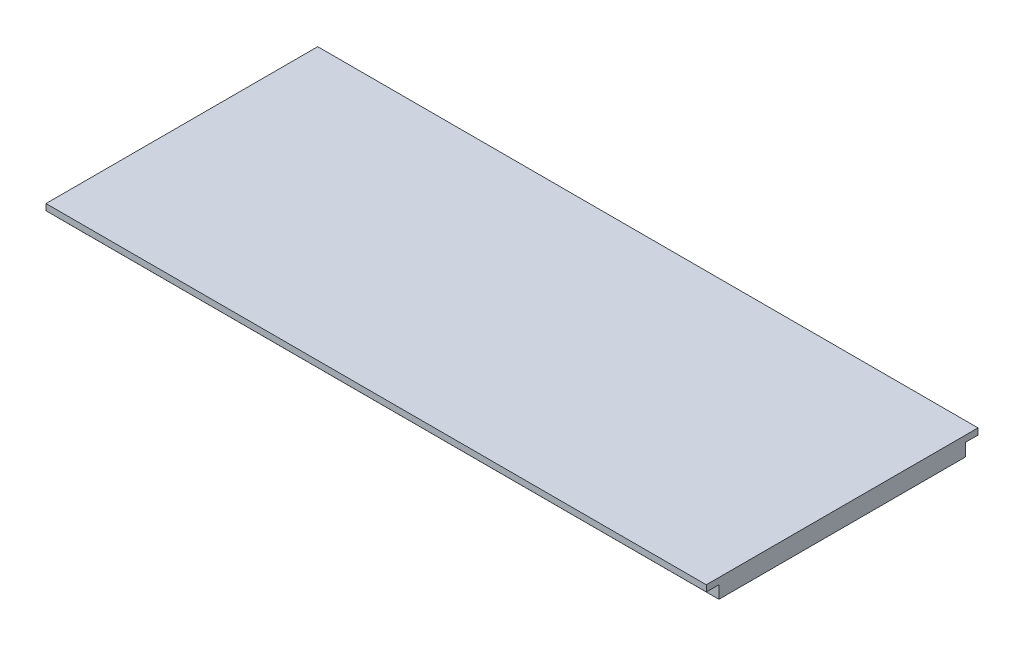
ISO-10303-21;
HEADER;
FILE_DESCRIPTION(('STEP AP214'),'2;1');
FILE_NAME('part.step','',(''),(''),'','','');
FILE_SCHEMA(('AUTOMOTIVE_DESIGN { 1 0 10303 214 1 1 1 1 }'));
ENDSEC;
DATA;
#1=APPLICATION_CONTEXT('core data for automotive mechanical design processes');
#2=APPLICATION_PROTOCOL_DEFINITION('international standard','automotive_design',2000,#1);
#3=PRODUCT_CONTEXT('',#1,'mechanical');
#4=PRODUCT('Part','Part','',(#3));
#5=PRODUCT_RELATED_PRODUCT_CATEGORY('part','',(#4));
#6=PRODUCT_DEFINITION_FORMATION('','',#4);
#7=PRODUCT_DEFINITION_CONTEXT('part definition',#1,'design');
#8=PRODUCT_DEFINITION('design','',#6,#7);
#9=PRODUCT_DEFINITION_SHAPE('','',#8);
#10=(LENGTH_UNIT() NAMED_UNIT(*) SI_UNIT(.MILLI.,.METRE.));
#11=(NAMED_UNIT(*) PLANE_ANGLE_UNIT() SI_UNIT($,.RADIAN.));
#12=(NAMED_UNIT(*) SI_UNIT($,.STERADIAN.) SOLID_ANGLE_UNIT());
#13=UNCERTAINTY_MEASURE_WITH_UNIT(LENGTH_MEASURE(1.E-05),#10,'distance_accuracy_value','');
#14=(GEOMETRIC_REPRESENTATION_CONTEXT(3) GLOBAL_UNCERTAINTY_ASSIGNED_CONTEXT((#13)) GLOBAL_UNIT_ASSIGNED_CONTEXT((#10,
#11,#12)) REPRESENTATION_CONTEXT('',''));
#15=CARTESIAN_POINT('',(0.,0.,0.));
#16=DIRECTION('',(0.,0.,1.));
#17=DIRECTION('',(1.,0.,0.));
#18=AXIS2_PLACEMENT_3D('',#15,#16,#17);
#19=CARTESIAN_POINT('',(-126.158859736553,-1.39491616665509,59.5667975060498));
#20=CARTESIAN_POINT('',(-126.158859736553,-1.48029661431821,61.5160693440243));
#21=CARTESIAN_POINT('',(-126.158859736553,-4.04894196367185,64.6148790021447));
#22=CARTESIAN_POINT('',(-126.158859736553,-9.90751310898822,61.8880120971785));
#23=CARTESIAN_POINT('',(-126.158859736553,-7.09308720635287,51.2562433251617));
#24=CARTESIAN_POINT('',(-126.158859736553,-1.70242173135367,44.0648360638056));
#25=CARTESIAN_POINT('',(-126.158859736553,-4.54860947372664,37.3845601025686));
#26=B_SPLINE_CURVE_WITH_KNOTS('',3,(#19,#20,#21,#22,#23,#24,#25),.UNSPECIFIED.,.F.,.F.,(4,1,1,1,
4),(0.,0.14225520680941,0.248971973828275,0.491101119975842,1.),.UNSPECIFIED.);
#27=DIRECTION('',(1.,0.,0.));
#28=VECTOR('',#27,1.);
#29=SURFACE_OF_LINEAR_EXTRUSION('',#26,#28);
#30=CARTESIAN_POINT('',(-88.0588597365526,-1.39491616665509,59.5667975060498));
#31=CARTESIAN_POINT('',(-88.0588597365526,-1.48029661431821,61.5160693440243));
#32=CARTESIAN_POINT('',(-88.0588597365526,-4.04894196367185,64.6148790021447));
#33=CARTESIAN_POINT('',(-88.0588597365526,-9.90751310898822,61.8880120971785));
#34=CARTESIAN_POINT('',(-88.0588597365526,-7.09308720635287,51.2562433251616));
#35=CARTESIAN_POINT('',(-88.0588597365526,-1.70242173135367,44.0648360638056));
#36=CARTESIAN_POINT('',(-88.0588597365526,-4.54860947372664,37.3845601025686));
#37=B_SPLINE_CURVE_WITH_KNOTS('',3,(#30,#31,#32,#33,#34,#35,#36),.UNSPECIFIED.,.F.,.F.,(4,1,1,1,
4),(0.,0.14225520680941,0.248971973828275,0.491101119975842,1.),.UNSPECIFIED.);
#38=CARTESIAN_POINT('',(-88.0588597365526,-1.39491616665509,59.5667975060498));
#39=VERTEX_POINT('',#38);
#40=CARTESIAN_POINT('',(-88.0588597365526,-4.54860947372663,37.3845601025686));
#41=VERTEX_POINT('',#40);
#42=EDGE_CURVE('E200',#39,#41,#37,.T.);
#43=ORIENTED_EDGE('',*,*,#42,.T.);
#44=DIRECTION('',(1.,0.,0.));
#45=VECTOR('',#44,1.);
#46=CARTESIAN_POINT('',(-126.158859736553,-4.54860947372663,37.3845601025686));
#47=LINE('',#46,#45);
#48=CARTESIAN_POINT('',(-126.158859736553,-4.54860947372663,37.3845601025686));
#49=VERTEX_POINT('',#48);
#50=EDGE_CURVE('E285',#49,#41,#47,.T.);
#51=ORIENTED_EDGE('',*,*,#50,.F.);
#52=CARTESIAN_POINT('',(-126.158859736553,-1.3949161666551,59.5667975060498));
#53=VERTEX_POINT('',#52);
#54=EDGE_CURVE('E201',#53,#49,#26,.T.);
#55=ORIENTED_EDGE('',*,*,#54,.F.);
#56=DIRECTION('',(1.,0.,0.));
#57=VECTOR('',#56,1.);
#58=CARTESIAN_POINT('',(-126.158859736553,-1.3949161666551,59.5667975060498));
#59=LINE('',#58,#57);
#60=EDGE_CURVE('E346',#53,#39,#59,.T.);
#61=ORIENTED_EDGE('',*,*,#60,.T.);
#62=EDGE_LOOP('',(#43,#51,#55,#61));
#63=FACE_BOUND('',#62,.T.);
#64=CARTESIAN_POINT('',(-95.6788597365526,-1.39491616665509,59.5667975060498));
#65=CARTESIAN_POINT('',(-95.6788597365526,-1.48029661431821,61.5160693440243));
#66=CARTESIAN_POINT('',(-95.6788597365526,-4.04894196367185,64.6148790021447));
#67=CARTESIAN_POINT('',(-95.6788597365526,-9.90751310898822,61.8880120971785));
#68=CARTESIAN_POINT('',(-95.6788597365526,-7.09308720635287,51.2562433251616));
#69=CARTESIAN_POINT('',(-95.6788597365526,-1.70242173135367,44.0648360638056));
#70=CARTESIAN_POINT('',(-95.6788597365526,-4.54860947372664,37.3845601025686));
#71=B_SPLINE_CURVE_WITH_KNOTS('',3,(#64,#65,#66,#67,#68,#69,#70),.UNSPECIFIED.,.F.,.F.,(4,1,1,1,
4),(0.,0.14225520680941,0.248971973828275,0.491101119975842,1.),.UNSPECIFIED.);
#72=CARTESIAN_POINT('',(-95.6788597365526,-8.50681272936786,57.2956126286987));
#73=VERTEX_POINT('',#72);
#74=CARTESIAN_POINT('',(-95.6788597365526,-3.92571770064945,45.502355942327));
#75=VERTEX_POINT('',#74);
#76=EDGE_CURVE('E164',#73,#75,#71,.T.);
#77=ORIENTED_EDGE('',*,*,#76,.F.);
#78=DIRECTION('',(1.,0.,0.));
#79=VECTOR('',#78,1.);
#80=CARTESIAN_POINT('',(-126.158859736553,-8.50681272936786,57.2956126286987));
#81=LINE('',#80,#79);
#82=CARTESIAN_POINT('',(-118.538859736553,-8.50681272936786,57.2956126286987));
#83=VERTEX_POINT('',#82);
#84=EDGE_CURVE('E186',#83,#73,#81,.T.);
#85=ORIENTED_EDGE('',*,*,#84,.F.);
#86=CARTESIAN_POINT('',(-118.538859736553,-1.39491616665509,59.5667975060498));
#87=CARTESIAN_POINT('',(-118.538859736553,-1.48029661431821,61.5160693440243));
#88=CARTESIAN_POINT('',(-118.538859736553,-4.04894196367185,64.6148790021447));
#89=CARTESIAN_POINT('',(-118.538859736553,-9.90751310898822,61.8880120971785));
#90=CARTESIAN_POINT('',(-118.538859736553,-7.09308720635287,51.2562433251617));
#91=CARTESIAN_POINT('',(-118.538859736553,-1.70242173135367,44.0648360638056));
#92=CARTESIAN_POINT('',(-118.538859736553,-4.54860947372664,37.3845601025686));
#93=B_SPLINE_CURVE_WITH_KNOTS('',3,(#86,#87,#88,#89,#90,#91,#92),.UNSPECIFIED.,.F.,.F.,(4,1,1,1,
4),(0.,0.14225520680941,0.248971973828275,0.491101119975842,1.),.UNSPECIFIED.);
#94=CARTESIAN_POINT('',(-118.538859736553,-3.92571770118928,45.502355942327));
#95=VERTEX_POINT('',#94);
#96=EDGE_CURVE('E188',#95,#83,#93,.F.);
#97=ORIENTED_EDGE('',*,*,#96,.F.);
#98=DIRECTION('',(1.,0.,0.));
#99=VECTOR('',#98,1.);
#100=CARTESIAN_POINT('',(-126.158859736553,-3.92571770064945,45.502355942327));
#101=LINE('',#100,#99);
#102=EDGE_CURVE('E192',#75,#95,#101,.F.);
#103=ORIENTED_EDGE('',*,*,#102,.F.);
#104=EDGE_LOOP('',(#77,#85,#97,#103));
#105=FACE_BOUND('',#104,.T.);
#106=ADVANCED_FACE('F36',(#63,#105),#29,.F.);
#107=CARTESIAN_POINT('',(-126.158859736553,-5.71698411480681,37.882355942327));
#108=CARTESIAN_POINT('',(-126.158859736553,-5.56334220902802,38.2429548334276));
#109=CARTESIAN_POINT('',(-126.158859736553,-5.28108494498123,38.9981374318016));
#110=CARTESIAN_POINT('',(-126.158859736553,-4.90892600324813,40.393560708878));
#111=CARTESIAN_POINT('',(-126.158859736553,-4.71932610533275,42.062160420203));
#112=CARTESIAN_POINT('',(-126.158859736553,-4.86196655765765,43.9810949091955));
#113=CARTESIAN_POINT('',(-126.158859736553,-5.45479976802843,46.5228523588809));
#114=CARTESIAN_POINT('',(-126.158859736553,-6.80646332334239,49.7569525071542));
#115=CARTESIAN_POINT('',(-126.158859736553,-8.4479282894016,53.2151114838994));
#116=CARTESIAN_POINT('',(-126.158859736553,-9.58908910753317,56.2637640118195));
#117=CARTESIAN_POINT('',(-126.158859736553,-10.1489465903297,58.6405053384097));
#118=CARTESIAN_POINT('',(-126.158859736553,-10.1157085610259,60.6603570457638));
#119=CARTESIAN_POINT('',(-126.158859736553,-9.54794373951042,62.2267501871865));
#120=CARTESIAN_POINT('',(-126.158859736553,-8.79448229134296,63.2945408435051));
#121=CARTESIAN_POINT('',(-126.158859736553,-7.74531410843987,64.1592455880178));
#122=CARTESIAN_POINT('',(-126.158859736553,-6.47688200560097,64.7616399765848));
#123=CARTESIAN_POINT('',(-126.158859736553,-5.01238982416159,65.0116930969087));
#124=CARTESIAN_POINT('',(-126.158859736553,-3.43892818214929,64.6757218015532));
#125=CARTESIAN_POINT('',(-126.158859736553,-2.14242727495017,63.8441999613932));
#126=CARTESIAN_POINT('',(-126.158859736553,-1.1018182514522,62.6838984715983));
#127=CARTESIAN_POINT('',(-126.158859736553,-0.373254595908957,61.2718107426635));
#128=CARTESIAN_POINT('',(-126.158859736553,-0.149654943870442,60.1683831356787));
#129=CARTESIAN_POINT('',(-126.158859736553,-0.125757298236289,59.6226222586608));
#130=B_SPLINE_CURVE_WITH_KNOTS('',3,(#107,#108,#109,#110,#111,#112,#113,#114,#115,#116,#117,
#118,#119,#120,#121,#122,#123,#124,#125,#126,#127,#128,#129),.UNSPECIFIED.,.F.,.F.,(4,1,1,1,1,1,
1,1,1,1,1,1,1,1,1,1,1,1,1,1,4),(0.,0.03125,0.0625,0.125,0.1875,0.25,0.375,0.5,0.5625,0.625,
0.6875,0.71875,0.75,0.78125,0.8125,0.84375,0.875,0.90625,0.9375,0.96875,1.),.UNSPECIFIED.);
#131=DIRECTION('',(1.,0.,0.));
#132=VECTOR('',#131,1.);
#133=SURFACE_OF_LINEAR_EXTRUSION('',#130,#132);
#134=CARTESIAN_POINT('',(-88.0588597365526,-5.71698411480681,37.882355942327));
#135=CARTESIAN_POINT('',(-88.0588597365526,-5.56334220902802,38.2429548334276));
#136=CARTESIAN_POINT('',(-88.0588597365526,-5.28108494498123,38.9981374318016));
#137=CARTESIAN_POINT('',(-88.0588597365526,-4.90892600324813,40.3935607088779));
#138=CARTESIAN_POINT('',(-88.0588597365526,-4.71932610533275,42.062160420203));
#139=CARTESIAN_POINT('',(-88.0588597365526,-4.86196655765765,43.9810949091954));
#140=CARTESIAN_POINT('',(-88.0588597365526,-5.45479976802843,46.5228523588809));
#141=CARTESIAN_POINT('',(-88.0588597365526,-6.80646332334239,49.7569525071542));
#142=CARTESIAN_POINT('',(-88.0588597365526,-8.4479282894016,53.2151114838993));
#143=CARTESIAN_POINT('',(-88.0588597365526,-9.58908910753317,56.2637640118195));
#144=CARTESIAN_POINT('',(-88.0588597365526,-10.1489465903297,58.6405053384097));
#145=CARTESIAN_POINT('',(-88.0588597365526,-10.1157085610259,60.6603570457638));
#146=CARTESIAN_POINT('',(-88.0588597365526,-9.54794373951042,62.2267501871865));
#147=CARTESIAN_POINT('',(-88.0588597365526,-8.79448229134296,63.2945408435051));
#148=CARTESIAN_POINT('',(-88.0588597365526,-7.74531410843987,64.1592455880178));
#149=CARTESIAN_POINT('',(-88.0588597365526,-6.47688200560097,64.7616399765848));
#150=CARTESIAN_POINT('',(-88.0588597365526,-5.01238982416159,65.0116930969086));
#151=CARTESIAN_POINT('',(-88.0588597365526,-3.43892818214929,64.6757218015532));
#152=CARTESIAN_POINT('',(-88.0588597365526,-2.14242727495017,63.8441999613931));
#153=CARTESIAN_POINT('',(-88.0588597365526,-1.1018182514522,62.6838984715983));
#154=CARTESIAN_POINT('',(-88.0588597365526,-0.373254595908957,61.2718107426635));
#155=CARTESIAN_POINT('',(-88.0588597365526,-0.149654943870442,60.1683831356787));
#156=CARTESIAN_POINT('',(-88.0588597365526,-0.125757298236289,59.6226222586608));
#157=B_SPLINE_CURVE_WITH_KNOTS('',3,(#134,#135,#136,#137,#138,#139,#140,#141,#142,#143,#144,
#145,#146,#147,#148,#149,#150,#151,#152,#153,#154,#155,#156),.UNSPECIFIED.,.F.,.F.,(4,1,1,1,1,1,
1,1,1,1,1,1,1,1,1,1,1,1,1,1,4),(0.,0.03125,0.0625,0.125,0.1875,0.25,0.375,0.5,0.5625,0.625,
0.6875,0.71875,0.75,0.78125,0.8125,0.84375,0.875,0.90625,0.9375,0.96875,1.),.UNSPECIFIED.);
#158=CARTESIAN_POINT('',(-88.0588597365526,-5.71698411480681,37.882355942327));
#159=VERTEX_POINT('',#158);
#160=CARTESIAN_POINT('',(-88.0588597365526,-1.39491616665514,62.9685125939913));
#161=VERTEX_POINT('',#160);
#162=EDGE_CURVE('E352',#159,#161,#157,.T.);
#163=ORIENTED_EDGE('',*,*,#162,.T.);
#164=DIRECTION('',(1.,0.,0.));
#165=VECTOR('',#164,1.);
#166=CARTESIAN_POINT('',(-126.158859736553,-1.39491616665514,62.9685125939913));
#167=LINE('',#166,#165);
#168=CARTESIAN_POINT('',(-126.158859736553,-1.39491616665514,62.9685125939913));
#169=VERTEX_POINT('',#168);
#170=EDGE_CURVE('E343',#169,#161,#167,.T.);
#171=ORIENTED_EDGE('',*,*,#170,.F.);
#172=CARTESIAN_POINT('',(-126.158859736553,-5.71698411480681,37.882355942327));
#173=VERTEX_POINT('',#172);
#174=EDGE_CURVE('E368',#173,#169,#130,.T.);
#175=ORIENTED_EDGE('',*,*,#174,.F.);
#176=DIRECTION('',(1.,0.,0.));
#177=VECTOR('',#176,1.);
#178=CARTESIAN_POINT('',(-126.158859736553,-5.71698411480681,37.882355942327));
#179=LINE('',#178,#177);
#180=EDGE_CURVE('E340',#173,#159,#179,.T.);
#181=ORIENTED_EDGE('',*,*,#180,.T.);
#182=EDGE_LOOP('',(#163,#171,#175,#181));
#183=FACE_BOUND('',#182,.T.);
#184=CARTESIAN_POINT('',(-95.6788597365526,-5.71698411480681,37.882355942327));
#185=CARTESIAN_POINT('',(-95.6788597365526,-5.56334220902802,38.2429548334276));
#186=CARTESIAN_POINT('',(-95.6788597365526,-5.28108494498123,38.9981374318016));
#187=CARTESIAN_POINT('',(-95.6788597365526,-4.90892600324813,40.3935607088779));
#188=CARTESIAN_POINT('',(-95.6788597365526,-4.71932610533275,42.062160420203));
#189=CARTESIAN_POINT('',(-95.6788597365526,-4.86196655765765,43.9810949091954));
#190=CARTESIAN_POINT('',(-95.6788597365526,-5.45479976802843,46.5228523588809));
#191=CARTESIAN_POINT('',(-95.6788597365526,-6.80646332334239,49.7569525071542));
#192=CARTESIAN_POINT('',(-95.6788597365526,-8.4479282894016,53.2151114838993));
#193=CARTESIAN_POINT('',(-95.6788597365526,-9.58908910753317,56.2637640118195));
#194=CARTESIAN_POINT('',(-95.6788597365526,-10.1489465903297,58.6405053384097));
#195=CARTESIAN_POINT('',(-95.6788597365526,-10.1157085610259,60.6603570457638));
#196=CARTESIAN_POINT('',(-95.6788597365526,-9.54794373951042,62.2267501871865));
#197=CARTESIAN_POINT('',(-95.6788597365526,-8.79448229134296,63.2945408435051));
#198=CARTESIAN_POINT('',(-95.6788597365526,-7.74531410843987,64.1592455880178));
#199=CARTESIAN_POINT('',(-95.6788597365526,-6.47688200560097,64.7616399765848));
#200=CARTESIAN_POINT('',(-95.6788597365526,-5.01238982416159,65.0116930969086));
#201=CARTESIAN_POINT('',(-95.6788597365526,-3.43892818214929,64.6757218015532));
#202=CARTESIAN_POINT('',(-95.6788597365526,-2.14242727495017,63.8441999613931));
#203=CARTESIAN_POINT('',(-95.6788597365526,-1.1018182514522,62.6838984715983));
#204=CARTESIAN_POINT('',(-95.6788597365526,-0.373254595908957,61.2718107426635));
#205=CARTESIAN_POINT('',(-95.6788597365526,-0.149654943870442,60.1683831356787));
#206=CARTESIAN_POINT('',(-95.6788597365526,-0.125757298236289,59.6226222586608));
#207=B_SPLINE_CURVE_WITH_KNOTS('',3,(#184,#185,#186,#187,#188,#189,#190,#191,#192,#193,#194,
#195,#196,#197,#198,#199,#200,#201,#202,#203,#204,#205,#206),.UNSPECIFIED.,.F.,.F.,(4,1,1,1,1,1,
1,1,1,1,1,1,1,1,1,1,1,1,1,1,4),(0.,0.03125,0.0625,0.125,0.1875,0.25,0.375,0.5,0.5625,0.625,
0.6875,0.71875,0.75,0.78125,0.8125,0.84375,0.875,0.90625,0.9375,0.96875,1.),.UNSPECIFIED.);
#208=CARTESIAN_POINT('',(-95.6788597365527,-9.8142459307497,57.2956126286987));
#209=VERTEX_POINT('',#208);
#210=CARTESIAN_POINT('',(-95.6788597365526,-5.23736869912946,45.502355942327));
#211=VERTEX_POINT('',#210);
#212=EDGE_CURVE('E161',#209,#211,#207,.F.);
#213=ORIENTED_EDGE('',*,*,#212,.T.);
#214=DIRECTION('',(1.,0.,0.));
#215=VECTOR('',#214,1.);
#216=CARTESIAN_POINT('',(-126.158859736553,-5.23736869912969,45.5023559423271));
#217=LINE('',#216,#215);
#218=CARTESIAN_POINT('',(-118.538859736553,-5.23736869912969,45.5023559423271));
#219=VERTEX_POINT('',#218);
#220=EDGE_CURVE('E148',#211,#219,#217,.F.);
#221=ORIENTED_EDGE('',*,*,#220,.T.);
#222=CARTESIAN_POINT('',(-118.538859736553,-5.71698411480681,37.882355942327));
#223=CARTESIAN_POINT('',(-118.538859736553,-5.56334220902802,38.2429548334276));
#224=CARTESIAN_POINT('',(-118.538859736553,-5.28108494498123,38.9981374318016));
#225=CARTESIAN_POINT('',(-118.538859736553,-4.90892600324813,40.393560708878));
#226=CARTESIAN_POINT('',(-118.538859736553,-4.71932610533275,42.062160420203));
#227=CARTESIAN_POINT('',(-118.538859736553,-4.86196655765765,43.9810949091955));
#228=CARTESIAN_POINT('',(-118.538859736553,-5.45479976802843,46.5228523588809));
#229=CARTESIAN_POINT('',(-118.538859736553,-6.80646332334239,49.7569525071542));
#230=CARTESIAN_POINT('',(-118.538859736553,-8.4479282894016,53.2151114838994));
#231=CARTESIAN_POINT('',(-118.538859736553,-9.58908910753317,56.2637640118195));
#232=CARTESIAN_POINT('',(-118.538859736553,-10.1489465903297,58.6405053384097));
#233=CARTESIAN_POINT('',(-118.538859736553,-10.1157085610259,60.6603570457638));
#234=CARTESIAN_POINT('',(-118.538859736553,-9.54794373951042,62.2267501871865));
#235=CARTESIAN_POINT('',(-118.538859736553,-8.79448229134296,63.2945408435051));
#236=CARTESIAN_POINT('',(-118.538859736553,-7.74531410843987,64.1592455880178));
#237=CARTESIAN_POINT('',(-118.538859736553,-6.47688200560097,64.7616399765848));
#238=CARTESIAN_POINT('',(-118.538859736553,-5.01238982416159,65.0116930969087));
#239=CARTESIAN_POINT('',(-118.538859736553,-3.43892818214929,64.6757218015532));
#240=CARTESIAN_POINT('',(-118.538859736553,-2.14242727495017,63.8441999613932));
#241=CARTESIAN_POINT('',(-118.538859736553,-1.1018182514522,62.6838984715983));
#242=CARTESIAN_POINT('',(-118.538859736553,-0.373254595908957,61.2718107426635));
#243=CARTESIAN_POINT('',(-118.538859736553,-0.149654943870442,60.1683831356787));
#244=CARTESIAN_POINT('',(-118.538859736553,-0.125757298236289,59.6226222586608));
#245=B_SPLINE_CURVE_WITH_KNOTS('',3,(#222,#223,#224,#225,#226,#227,#228,#229,#230,#231,#232,
#233,#234,#235,#236,#237,#238,#239,#240,#241,#242,#243,#244),.UNSPECIFIED.,.F.,.F.,(4,1,1,1,1,1,
1,1,1,1,1,1,1,1,1,1,1,1,1,1,4),(0.,0.03125,0.0625,0.125,0.1875,0.25,0.375,0.5,0.5625,0.625,
0.6875,0.71875,0.75,0.78125,0.8125,0.84375,0.875,0.90625,0.9375,0.96875,1.),.UNSPECIFIED.);
#246=CARTESIAN_POINT('',(-118.538859736553,-9.81424593075065,57.2956126287028));
#247=VERTEX_POINT('',#246);
#248=EDGE_CURVE('E176',#219,#247,#245,.T.);
#249=ORIENTED_EDGE('',*,*,#248,.T.);
#250=DIRECTION('',(1.,0.,0.));
#251=VECTOR('',#250,1.);
#252=CARTESIAN_POINT('',(-126.158859736553,-9.8142459307497,57.2956126286987));
#253=LINE('',#252,#251);
#254=EDGE_CURVE('E167',#247,#209,#253,.T.);
#255=ORIENTED_EDGE('',*,*,#254,.T.);
#256=EDGE_LOOP('',(#213,#221,#249,#255));
#257=FACE_BOUND('',#256,.T.);
#258=ADVANCED_FACE('F166',(#183,#257),#133,.F.);
#259=CARTESIAN_POINT('',(-3.454335612048,-1.39491616665509,0.));
#260=DIRECTION('',(0.,-1.,0.));
#261=DIRECTION('',(0.,0.,-1.));
#262=AXIS2_PLACEMENT_3D('',#259,#260,#261);
#263=PLANE('',#262);
#264=DIRECTION('',(0.,0.,-1.));
#265=VECTOR('',#264,1.);
#266=CARTESIAN_POINT('',(-47.0668597365527,-1.39491616665509,0.));
#267=LINE('',#266,#265);
#268=CARTESIAN_POINT('',(-47.0668597365526,-1.39491616665509,78.5853825453996));
#269=VERTEX_POINT('',#268);
#270=CARTESIAN_POINT('',(-47.0668597365527,-1.39491616665509,39.5853825453996));
#271=VERTEX_POINT('',#270);
#272=EDGE_CURVE('E44',#269,#271,#267,.T.);
#273=ORIENTED_EDGE('',*,*,#272,.F.);
#274=DIRECTION('',(-1.,0.,0.));
#275=VECTOR('',#274,1.);
#276=CARTESIAN_POINT('',(-3.454335612048,-1.39491616665509,78.5853825453996));
#277=LINE('',#276,#275);
#278=CARTESIAN_POINT('',(-151.558859736553,-1.39491616665509,78.5853825453997));
#279=VERTEX_POINT('',#278);
#280=EDGE_CURVE('E265',#269,#279,#277,.T.);
#281=ORIENTED_EDGE('',*,*,#280,.T.);
#282=DIRECTION('',(0.,0.,1.));
#283=VECTOR('',#282,1.);
#284=CARTESIAN_POINT('',(-151.558859736553,-1.39491616665509,0.));
#285=LINE('',#284,#283);
#286=CARTESIAN_POINT('',(-151.558859736553,-1.39491616665509,39.5853825453997));
#287=VERTEX_POINT('',#286);
#288=EDGE_CURVE('E281',#287,#279,#285,.T.);
#289=ORIENTED_EDGE('',*,*,#288,.F.);
#290=DIRECTION('',(-1.,0.,0.));
#291=VECTOR('',#290,1.);
#292=CARTESIAN_POINT('',(-3.454335612048,-1.39491616665509,39.5853825453996));
#293=LINE('',#292,#291);
#294=EDGE_CURVE('E274',#271,#287,#293,.T.);
#295=ORIENTED_EDGE('',*,*,#294,.F.);
#296=EDGE_LOOP('',(#273,#281,#289,#295));
#297=FACE_BOUND('',#296,.T.);
#298=DIRECTION('',(0.,0.,-1.));
#299=VECTOR('',#298,1.);
#300=CARTESIAN_POINT('',(-126.158859736553,-1.3949161666551,59.5667975060498));
#301=LINE('',#300,#299);
#302=EDGE_CURVE('E349',#169,#53,#301,.T.);
#303=ORIENTED_EDGE('',*,*,#302,.F.);
#304=ORIENTED_EDGE('',*,*,#170,.T.);
#305=DIRECTION('',(0.,0.,-1.));
#306=VECTOR('',#305,1.);
#307=CARTESIAN_POINT('',(-88.0588597365526,-1.3949161666551,59.5667975060498));
#308=LINE('',#307,#306);
#309=EDGE_CURVE('E211',#161,#39,#308,.T.);
#310=ORIENTED_EDGE('',*,*,#309,.T.);
#311=ORIENTED_EDGE('',*,*,#60,.F.);
#312=EDGE_LOOP('',(#303,#304,#310,#311));
#313=FACE_BOUND('',#312,.T.);
#314=ADVANCED_FACE('F38',(#297,#313),#263,.T.);
#315=CARTESIAN_POINT('',(-3.454335612048,2.73584431900507E-13,39.5853825453996));
#316=DIRECTION('',(0.,0.,1.));
#317=DIRECTION('',(0.,-1.,0.));
#318=AXIS2_PLACEMENT_3D('',#315,#316,#317);
#319=PLANE('',#318);
#320=DIRECTION('',(-1.,0.,0.));
#321=VECTOR('',#320,1.);
#322=CARTESIAN_POINT('',(-3.454335612048,0.613083833344912,39.5853825453996));
#323=LINE('',#322,#321);
#324=CARTESIAN_POINT('',(-47.0668597365527,0.613083833344912,39.5853825453997));
#325=VERTEX_POINT('',#324);
#326=CARTESIAN_POINT('',(-151.558859736553,0.613083833344912,39.5853825453997));
#327=VERTEX_POINT('',#326);
#328=EDGE_CURVE('E307',#325,#327,#323,.T.);
#329=ORIENTED_EDGE('',*,*,#328,.F.);
#330=DIRECTION('',(0.,-1.,0.));
#331=VECTOR('',#330,1.);
#332=CARTESIAN_POINT('',(-47.0668597365527,2.73584431900507E-13,39.5853825453996));
#333=LINE('',#332,#331);
#334=EDGE_CURVE('E275',#325,#271,#333,.T.);
#335=ORIENTED_EDGE('',*,*,#334,.T.);
#336=ORIENTED_EDGE('',*,*,#294,.T.);
#337=DIRECTION('',(0.,1.,0.));
#338=VECTOR('',#337,1.);
#339=CARTESIAN_POINT('',(-151.558859736553,2.73584431900507E-13,39.5853825453997));
#340=LINE('',#339,#338);
#341=EDGE_CURVE('E303',#287,#327,#340,.T.);
#342=ORIENTED_EDGE('',*,*,#341,.T.);
#343=EDGE_LOOP('',(#329,#335,#336,#342));
#344=FACE_BOUND('',#343,.T.);
#345=ADVANCED_FACE('F232',(#344),#319,.F.);
#346=CARTESIAN_POINT('',(-3.454335612048,0.613083833344752,0.));
#347=DIRECTION('',(0.,1.,0.));
#348=DIRECTION('',(0.,0.,1.));
#349=AXIS2_PLACEMENT_3D('',#346,#347,#348);
#350=PLANE('',#349);
#351=DIRECTION('',(-1.,0.,0.));
#352=VECTOR('',#351,1.);
#353=CARTESIAN_POINT('',(-3.454335612048,0.613083833344904,37.5853825453996));
#354=LINE('',#353,#352);
#355=CARTESIAN_POINT('',(-47.0668597365527,0.613083833344904,37.5853825453996));
#356=VERTEX_POINT('',#355);
#357=CARTESIAN_POINT('',(-151.558859736553,0.613083833344904,37.5853825453997));
#358=VERTEX_POINT('',#357);
#359=EDGE_CURVE('E309',#356,#358,#354,.T.);
#360=ORIENTED_EDGE('',*,*,#359,.F.);
#361=DIRECTION('',(0.,0.,1.));
#362=VECTOR('',#361,1.);
#363=CARTESIAN_POINT('',(-47.0668597365527,0.613083833344752,0.));
#364=LINE('',#363,#362);
#365=EDGE_CURVE('E277',#356,#325,#364,.T.);
#366=ORIENTED_EDGE('',*,*,#365,.T.);
#367=ORIENTED_EDGE('',*,*,#328,.T.);
#368=DIRECTION('',(0.,0.,-1.));
#369=VECTOR('',#368,1.);
#370=CARTESIAN_POINT('',(-151.558859736553,0.613083833344752,0.));
#371=LINE('',#370,#369);
#372=EDGE_CURVE('E300',#327,#358,#371,.T.);
#373=ORIENTED_EDGE('',*,*,#372,.T.);
#374=EDGE_LOOP('',(#360,#366,#367,#373));
#375=FACE_BOUND('',#374,.T.);
#376=ADVANCED_FACE('F235',(#375),#350,.F.);
#377=CARTESIAN_POINT('',(-3.454335612048,2.62904215544652E-13,37.5853825453996));
#378=DIRECTION('',(0.,0.,1.));
#379=DIRECTION('',(0.,-1.,0.));
#380=AXIS2_PLACEMENT_3D('',#377,#378,#379);
#381=PLANE('',#380);
#382=DIRECTION('',(-1.,0.,0.));
#383=VECTOR('',#382,1.);
#384=CARTESIAN_POINT('',(-3.454335612048,1.6050838333449,37.5853825453996));
#385=LINE('',#384,#383);
#386=CARTESIAN_POINT('',(-47.0668597365527,1.6050838333449,37.5853825453996));
#387=VERTEX_POINT('',#386);
#388=CARTESIAN_POINT('',(-151.558859736553,1.6050838333449,37.5853825453996));
#389=VERTEX_POINT('',#388);
#390=EDGE_CURVE('E311',#387,#389,#385,.T.);
#391=ORIENTED_EDGE('',*,*,#390,.F.);
#392=DIRECTION('',(0.,-1.,0.));
#393=VECTOR('',#392,1.);
#394=CARTESIAN_POINT('',(-47.0668597365527,2.62904215544652E-13,37.5853825453996));
#395=LINE('',#394,#393);
#396=EDGE_CURVE('E329',#387,#356,#395,.T.);
#397=ORIENTED_EDGE('',*,*,#396,.T.);
#398=ORIENTED_EDGE('',*,*,#359,.T.);
#399=DIRECTION('',(0.,1.,0.));
#400=VECTOR('',#399,1.);
#401=CARTESIAN_POINT('',(-151.558859736553,2.62904215544652E-13,37.5853825453997));
#402=LINE('',#401,#400);
#403=EDGE_CURVE('E297',#358,#389,#402,.T.);
#404=ORIENTED_EDGE('',*,*,#403,.T.);
#405=EDGE_LOOP('',(#391,#397,#398,#404));
#406=FACE_BOUND('',#405,.T.);
#407=ADVANCED_FACE('F239',(#406),#381,.F.);
#408=CARTESIAN_POINT('',(-3.454335612048,1.6050838333449,0.));
#409=DIRECTION('',(0.,-1.,0.));
#410=DIRECTION('',(0.,0.,-1.));
#411=AXIS2_PLACEMENT_3D('',#408,#409,#410);
#412=PLANE('',#411);
#413=DIRECTION('',(-1.,0.,0.));
#414=VECTOR('',#413,1.);
#415=CARTESIAN_POINT('',(-3.454335612048,1.6050838333449,80.5853825453996));
#416=LINE('',#415,#414);
#417=CARTESIAN_POINT('',(-47.0668597365526,1.6050838333449,80.5853825453997));
#418=VERTEX_POINT('',#417);
#419=CARTESIAN_POINT('',(-151.558859736553,1.6050838333449,80.5853825453997));
#420=VERTEX_POINT('',#419);
#421=EDGE_CURVE('E313',#418,#420,#416,.T.);
#422=ORIENTED_EDGE('',*,*,#421,.F.);
#423=DIRECTION('',(0.,0.,-1.));
#424=VECTOR('',#423,1.);
#425=CARTESIAN_POINT('',(-47.0668597365527,1.6050838333449,0.));
#426=LINE('',#425,#424);
#427=EDGE_CURVE('E330',#418,#387,#426,.T.);
#428=ORIENTED_EDGE('',*,*,#427,.T.);
#429=ORIENTED_EDGE('',*,*,#390,.T.);
#430=DIRECTION('',(0.,0.,1.));
#431=VECTOR('',#430,1.);
#432=CARTESIAN_POINT('',(-151.558859736553,1.6050838333449,0.));
#433=LINE('',#432,#431);
#434=EDGE_CURVE('E294',#389,#420,#433,.T.);
#435=ORIENTED_EDGE('',*,*,#434,.T.);
#436=EDGE_LOOP('',(#422,#428,#429,#435));
#437=FACE_BOUND('',#436,.T.);
#438=ADVANCED_FACE('F243',(#437),#412,.F.);
#439=CARTESIAN_POINT('',(-3.454335612048,-2.25473153100123E-12,80.5853825453996));
#440=DIRECTION('',(0.,0.,1.));
#441=DIRECTION('',(0.,-1.,0.));
#442=AXIS2_PLACEMENT_3D('',#439,#440,#441);
#443=PLANE('',#442);
#444=DIRECTION('',(0.,-1.,0.));
#445=VECTOR('',#444,1.);
#446=CARTESIAN_POINT('',(-47.0668597365526,-2.25473153100123E-12,80.5853825453996));
#447=LINE('',#446,#445);
#448=CARTESIAN_POINT('',(-47.0668597365526,0.613083833344904,80.5853825453997));
#449=VERTEX_POINT('',#448);
#450=EDGE_CURVE('E335',#418,#449,#447,.T.);
#451=ORIENTED_EDGE('',*,*,#450,.F.);
#452=ORIENTED_EDGE('',*,*,#421,.T.);
#453=DIRECTION('',(0.,1.,0.));
#454=VECTOR('',#453,1.);
#455=CARTESIAN_POINT('',(-151.558859736553,-2.25473153100123E-12,80.5853825453997));
#456=LINE('',#455,#454);
#457=CARTESIAN_POINT('',(-151.558859736553,0.613083833344904,80.5853825453997));
#458=VERTEX_POINT('',#457);
#459=EDGE_CURVE('E291',#458,#420,#456,.T.);
#460=ORIENTED_EDGE('',*,*,#459,.F.);
#461=DIRECTION('',(-1.,0.,0.));
#462=VECTOR('',#461,1.);
#463=CARTESIAN_POINT('',(-3.454335612048,0.613083833344904,80.5853825453996));
#464=LINE('',#463,#462);
#465=EDGE_CURVE('E315',#449,#458,#464,.T.);
#466=ORIENTED_EDGE('',*,*,#465,.F.);
#467=EDGE_LOOP('',(#451,#452,#460,#466));
#468=FACE_BOUND('',#467,.T.);
#469=ADVANCED_FACE('F247',(#468),#443,.T.);
#470=CARTESIAN_POINT('',(-3.454335612048,0.613083833345144,0.));
#471=DIRECTION('',(0.,-1.,0.));
#472=DIRECTION('',(0.,0.,-1.));
#473=AXIS2_PLACEMENT_3D('',#470,#471,#472);
#474=PLANE('',#473);
#475=DIRECTION('',(0.,0.,-1.));
#476=VECTOR('',#475,1.);
#477=CARTESIAN_POINT('',(-47.0668597365527,0.613083833345144,0.));
#478=LINE('',#477,#476);
#479=CARTESIAN_POINT('',(-47.0668597365526,0.61308383334491,78.5853825453996));
#480=VERTEX_POINT('',#479);
#481=EDGE_CURVE('E269',#449,#480,#478,.T.);
#482=ORIENTED_EDGE('',*,*,#481,.F.);
#483=ORIENTED_EDGE('',*,*,#465,.T.);
#484=DIRECTION('',(0.,0.,1.));
#485=VECTOR('',#484,1.);
#486=CARTESIAN_POINT('',(-151.558859736553,0.613083833345144,0.));
#487=LINE('',#486,#485);
#488=CARTESIAN_POINT('',(-151.558859736553,0.61308383334491,78.5853825453997));
#489=VERTEX_POINT('',#488);
#490=EDGE_CURVE('E288',#489,#458,#487,.T.);
#491=ORIENTED_EDGE('',*,*,#490,.F.);
#492=DIRECTION('',(-1.,0.,0.));
#493=VECTOR('',#492,1.);
#494=CARTESIAN_POINT('',(-3.454335612048,0.61308383334491,78.5853825453996));
#495=LINE('',#494,#493);
#496=EDGE_CURVE('E263',#480,#489,#495,.T.);
#497=ORIENTED_EDGE('',*,*,#496,.F.);
#498=EDGE_LOOP('',(#482,#483,#491,#497));
#499=FACE_BOUND('',#498,.T.);
#500=ADVANCED_FACE('F251',(#499),#474,.T.);
#501=CARTESIAN_POINT('',(-3.454335612048,0.,78.5853825453996));
#502=DIRECTION('',(0.,0.,1.));
#503=DIRECTION('',(1.,0.,0.));
#504=AXIS2_PLACEMENT_3D('',#501,#502,#503);
#505=PLANE('',#504);
#506=DIRECTION('',(0.,-1.,0.));
#507=VECTOR('',#506,1.);
#508=CARTESIAN_POINT('',(-47.0668597365526,0.,78.5853825453996));
#509=LINE('',#508,#507);
#510=EDGE_CURVE('E12',#480,#269,#509,.T.);
#511=ORIENTED_EDGE('',*,*,#510,.F.);
#512=ORIENTED_EDGE('',*,*,#496,.T.);
#513=DIRECTION('',(0.,1.,0.));
#514=VECTOR('',#513,1.);
#515=CARTESIAN_POINT('',(-151.558859736553,0.,78.5853825453997));
#516=LINE('',#515,#514);
#517=EDGE_CURVE('E284',#279,#489,#516,.T.);
#518=ORIENTED_EDGE('',*,*,#517,.F.);
#519=ORIENTED_EDGE('',*,*,#280,.F.);
#520=EDGE_LOOP('',(#511,#512,#518,#519));
#521=FACE_BOUND('',#520,.T.);
#522=ADVANCED_FACE('F230',(#521),#505,.T.);
#523=CARTESIAN_POINT('',(-151.558859736553,0.,0.));
#524=DIRECTION('',(-1.,0.,0.));
#525=DIRECTION('',(0.,0.,1.));
#526=AXIS2_PLACEMENT_3D('',#523,#524,#525);
#527=PLANE('',#526);
#528=ORIENTED_EDGE('',*,*,#288,.T.);
#529=ORIENTED_EDGE('',*,*,#517,.T.);
#530=ORIENTED_EDGE('',*,*,#490,.T.);
#531=ORIENTED_EDGE('',*,*,#459,.T.);
#532=ORIENTED_EDGE('',*,*,#434,.F.);
#533=ORIENTED_EDGE('',*,*,#403,.F.);
#534=ORIENTED_EDGE('',*,*,#372,.F.);
#535=ORIENTED_EDGE('',*,*,#341,.F.);
#536=EDGE_LOOP('',(#528,#529,#530,#531,#532,#533,#534,#535));
#537=FACE_BOUND('',#536,.T.);
#538=ADVANCED_FACE('F226',(#537),#527,.T.);
#539=CARTESIAN_POINT('',(-47.0668597365526,28.6050838333449,84.0853825453996));
#540=DIRECTION('',(-1.,0.,0.));
#541=DIRECTION('',(0.,0.,1.));
#542=AXIS2_PLACEMENT_3D('',#539,#540,#541);
#543=PLANE('',#542);
#544=ORIENTED_EDGE('',*,*,#272,.T.);
#545=ORIENTED_EDGE('',*,*,#334,.F.);
#546=ORIENTED_EDGE('',*,*,#365,.F.);
#547=ORIENTED_EDGE('',*,*,#396,.F.);
#548=ORIENTED_EDGE('',*,*,#427,.F.);
#549=ORIENTED_EDGE('',*,*,#450,.T.);
#550=ORIENTED_EDGE('',*,*,#481,.T.);
#551=ORIENTED_EDGE('',*,*,#510,.T.);
#552=EDGE_LOOP('',(#544,#545,#546,#547,#548,#549,#550,#551));
#553=FACE_BOUND('',#552,.T.);
#554=ADVANCED_FACE('F223',(#553),#543,.F.);
#555=CARTESIAN_POINT('',(-126.158859736553,-5.14921517521174,37.5949225056523));
#556=DIRECTION('',(1.,0.,0.));
#557=DIRECTION('',(0.,0.,-1.));
#558=AXIS2_PLACEMENT_3D('',#555,#556,#557);
#559=CYLINDRICAL_SURFACE('',#558,0.636380035267883);
#560=CARTESIAN_POINT('',(-88.0588597365526,-5.14921517521174,37.5949225056523));
#561=DIRECTION('',(-1.,0.,0.));
#562=DIRECTION('',(0.,0.,1.));
#563=AXIS2_PLACEMENT_3D('',#560,#561,#562);
#564=CIRCLE('',#563,0.636380035267883);
#565=EDGE_CURVE('E356',#41,#159,#564,.T.);
#566=ORIENTED_EDGE('',*,*,#565,.T.);
#567=ORIENTED_EDGE('',*,*,#180,.F.);
#568=CARTESIAN_POINT('',(-126.158859736553,-5.14921517521174,37.5949225056523));
#569=DIRECTION('',(-1.,0.,0.));
#570=DIRECTION('',(0.,0.,1.));
#571=AXIS2_PLACEMENT_3D('',#568,#569,#570);
#572=CIRCLE('',#571,0.636380035267883);
#573=EDGE_CURVE('E210',#49,#173,#572,.T.);
#574=ORIENTED_EDGE('',*,*,#573,.F.);
#575=ORIENTED_EDGE('',*,*,#50,.T.);
#576=EDGE_LOOP('',(#566,#567,#574,#575));
#577=FACE_BOUND('',#576,.T.);
#578=ADVANCED_FACE('F221',(#577),#559,.T.);
#579=CARTESIAN_POINT('',(-126.158859736553,-7.54191640292193,54.4772040467866));
#580=DIRECTION('',(-1.,0.,0.));
#581=DIRECTION('',(0.,0.,1.));
#582=AXIS2_PLACEMENT_3D('',#579,#580,#581);
#583=PLANE('',#582);
#584=ORIENTED_EDGE('',*,*,#54,.T.);
#585=ORIENTED_EDGE('',*,*,#573,.T.);
#586=ORIENTED_EDGE('',*,*,#174,.T.);
#587=ORIENTED_EDGE('',*,*,#302,.T.);
#588=EDGE_LOOP('',(#584,#585,#586,#587));
#589=FACE_BOUND('',#588,.T.);
#590=ADVANCED_FACE('F381',(#589),#583,.T.);
#591=CARTESIAN_POINT('',(-88.0588597365526,-7.54191640292193,54.4772040467866));
#592=DIRECTION('',(-1.,0.,0.));
#593=DIRECTION('',(0.,0.,1.));
#594=AXIS2_PLACEMENT_3D('',#591,#592,#593);
#595=PLANE('',#594);
#596=ORIENTED_EDGE('',*,*,#42,.F.);
#597=ORIENTED_EDGE('',*,*,#309,.F.);
#598=ORIENTED_EDGE('',*,*,#162,.F.);
#599=ORIENTED_EDGE('',*,*,#565,.F.);
#600=EDGE_LOOP('',(#596,#597,#598,#599));
#601=FACE_BOUND('',#600,.T.);
#602=ADVANCED_FACE('F378',(#601),#595,.F.);
#603=CARTESIAN_POINT('',(-95.6788597365526,-10.1499465903302,45.5023559423271));
#604=DIRECTION('',(-1.,0.,0.));
#605=DIRECTION('',(0.,-1.,0.));
#606=AXIS2_PLACEMENT_3D('',#603,#604,#605);
#607=PLANE('',#606);
#608=ORIENTED_EDGE('',*,*,#76,.T.);
#609=DIRECTION('',(0.,1.,0.));
#610=VECTOR('',#609,1.);
#611=CARTESIAN_POINT('',(-95.6788597365526,-10.1499465903302,45.5023559423271));
#612=LINE('',#611,#610);
#613=EDGE_CURVE('E151',#211,#75,#612,.T.);
#614=ORIENTED_EDGE('',*,*,#613,.F.);
#615=ORIENTED_EDGE('',*,*,#212,.F.);
#616=DIRECTION('',(0.,1.,0.));
#617=VECTOR('',#616,1.);
#618=CARTESIAN_POINT('',(-95.6788597365526,-10.1499465903301,57.2956126286987));
#619=LINE('',#618,#617);
#620=EDGE_CURVE('E56',#209,#73,#619,.T.);
#621=ORIENTED_EDGE('',*,*,#620,.T.);
#622=EDGE_LOOP('',(#608,#614,#615,#621));
#623=FACE_BOUND('',#622,.T.);
#624=ADVANCED_FACE('F160',(#623),#607,.T.);
#625=CARTESIAN_POINT('',(-118.538859736553,-10.1499465903302,45.5023559423271));
#626=DIRECTION('',(0.,0.,1.));
#627=DIRECTION('',(0.,-1.,0.));
#628=AXIS2_PLACEMENT_3D('',#625,#626,#627);
#629=PLANE('',#628);
#630=ORIENTED_EDGE('',*,*,#102,.T.);
#631=DIRECTION('',(0.,1.,0.));
#632=VECTOR('',#631,1.);
#633=CARTESIAN_POINT('',(-118.538859736553,-10.1499465903302,45.5023559423271));
#634=LINE('',#633,#632);
#635=EDGE_CURVE('E154',#219,#95,#634,.T.);
#636=ORIENTED_EDGE('',*,*,#635,.F.);
#637=ORIENTED_EDGE('',*,*,#220,.F.);
#638=ORIENTED_EDGE('',*,*,#613,.T.);
#639=EDGE_LOOP('',(#630,#636,#637,#638));
#640=FACE_BOUND('',#639,.T.);
#641=ADVANCED_FACE('F150',(#640),#629,.T.);
#642=CARTESIAN_POINT('',(-118.538859736553,-10.1499465903301,57.2956126286987));
#643=DIRECTION('',(1.,0.,0.));
#644=DIRECTION('',(0.,1.,0.));
#645=AXIS2_PLACEMENT_3D('',#642,#643,#644);
#646=PLANE('',#645);
#647=ORIENTED_EDGE('',*,*,#96,.T.);
#648=DIRECTION('',(0.,1.,0.));
#649=VECTOR('',#648,1.);
#650=CARTESIAN_POINT('',(-118.538859736553,-10.1499465903301,57.2956126286987));
#651=LINE('',#650,#649);
#652=EDGE_CURVE('E51',#247,#83,#651,.T.);
#653=ORIENTED_EDGE('',*,*,#652,.F.);
#654=ORIENTED_EDGE('',*,*,#248,.F.);
#655=ORIENTED_EDGE('',*,*,#635,.T.);
#656=EDGE_LOOP('',(#647,#653,#654,#655));
#657=FACE_BOUND('',#656,.T.);
#658=ADVANCED_FACE('F390',(#657),#646,.T.);
#659=CARTESIAN_POINT('',(-95.6788597365526,-10.1499465903301,57.2956126286987));
#660=DIRECTION('',(0.,0.,-1.));
#661=DIRECTION('',(0.,1.,0.));
#662=AXIS2_PLACEMENT_3D('',#659,#660,#661);
#663=PLANE('',#662);
#664=ORIENTED_EDGE('',*,*,#84,.T.);
#665=ORIENTED_EDGE('',*,*,#620,.F.);
#666=ORIENTED_EDGE('',*,*,#254,.F.);
#667=ORIENTED_EDGE('',*,*,#652,.T.);
#668=EDGE_LOOP('',(#664,#665,#666,#667));
#669=FACE_BOUND('',#668,.T.);
#670=ADVANCED_FACE('F393',(#669),#663,.T.);
#671=CLOSED_SHELL('',(#106,#258,#314,#345,#376,#407,#438,#469,#500,#522,#538,#554,#578,#590,
#602,#624,#641,#658,#670));
#672=MANIFOLD_SOLID_BREP('B2',#671);
#673=ADVANCED_BREP_SHAPE_REPRESENTATION('',(#18,#672),#14);
#674=SHAPE_DEFINITION_REPRESENTATION(#9,#673);
ENDSEC;
END-ISO-10303-21;
